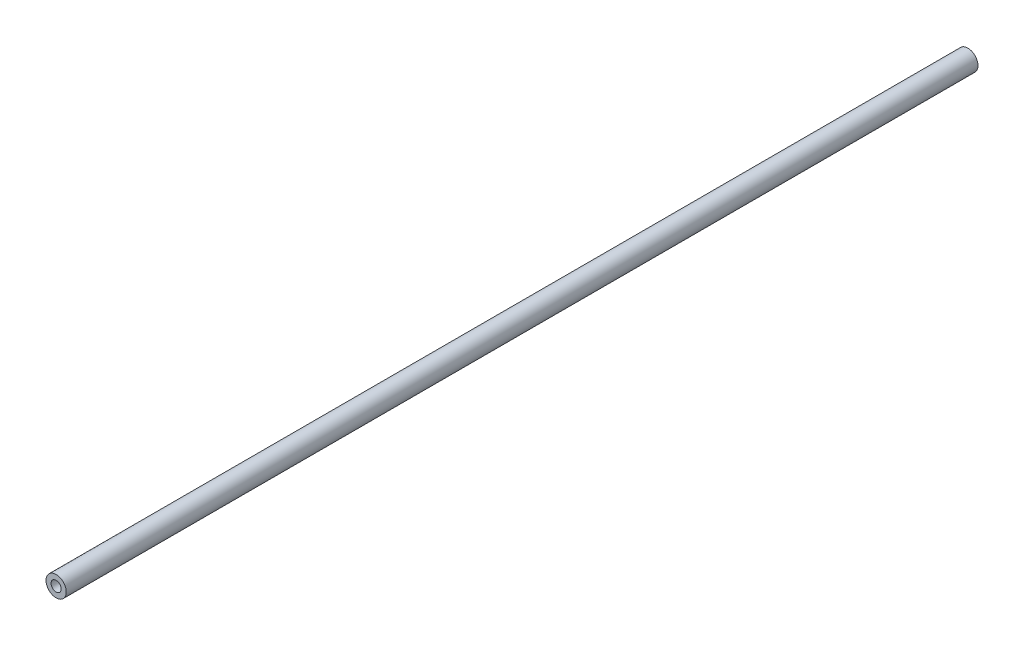
ISO-10303-21;
HEADER;
FILE_DESCRIPTION(('STEP AP214'),'2;1');
FILE_NAME('part.step','',(''),(''),'','','');
FILE_SCHEMA(('AUTOMOTIVE_DESIGN { 1 0 10303 214 1 1 1 1 }'));
ENDSEC;
DATA;
#1=APPLICATION_CONTEXT('core data for automotive mechanical design processes');
#2=APPLICATION_PROTOCOL_DEFINITION('international standard','automotive_design',2000,#1);
#3=PRODUCT_CONTEXT('',#1,'mechanical');
#4=PRODUCT('Part','Part','',(#3));
#5=PRODUCT_RELATED_PRODUCT_CATEGORY('part','',(#4));
#6=PRODUCT_DEFINITION_FORMATION('','',#4);
#7=PRODUCT_DEFINITION_CONTEXT('part definition',#1,'design');
#8=PRODUCT_DEFINITION('design','',#6,#7);
#9=PRODUCT_DEFINITION_SHAPE('','',#8);
#10=(LENGTH_UNIT() NAMED_UNIT(*) SI_UNIT(.MILLI.,.METRE.));
#11=(NAMED_UNIT(*) PLANE_ANGLE_UNIT() SI_UNIT($,.RADIAN.));
#12=(NAMED_UNIT(*) SI_UNIT($,.STERADIAN.) SOLID_ANGLE_UNIT());
#13=UNCERTAINTY_MEASURE_WITH_UNIT(LENGTH_MEASURE(1.E-05),#10,'distance_accuracy_value','');
#14=(GEOMETRIC_REPRESENTATION_CONTEXT(3) GLOBAL_UNCERTAINTY_ASSIGNED_CONTEXT((#13)) GLOBAL_UNIT_ASSIGNED_CONTEXT((#10,
#11,#12)) REPRESENTATION_CONTEXT('',''));
#15=CARTESIAN_POINT('',(0.,0.,0.));
#16=DIRECTION('',(0.,0.,1.));
#17=DIRECTION('',(1.,0.,0.));
#18=AXIS2_PLACEMENT_3D('',#15,#16,#17);
#19=CARTESIAN_POINT('',(0.,0.,180.));
#20=DIRECTION('',(0.,0.,1.));
#21=DIRECTION('',(1.,0.,0.));
#22=AXIS2_PLACEMENT_3D('',#19,#20,#21);
#23=PLANE('',#22);
#24=CARTESIAN_POINT('',(0.,0.,180.));
#25=DIRECTION('',(0.,0.,1.));
#26=DIRECTION('',(1.,0.,0.));
#27=AXIS2_PLACEMENT_3D('',#24,#25,#26);
#28=CIRCLE('',#27,2.);
#29=CARTESIAN_POINT('',(2.,0.,180.));
#30=VERTEX_POINT('',#29);
#31=EDGE_CURVE('E10',#30,#30,#28,.T.);
#32=ORIENTED_EDGE('',*,*,#31,.T.);
#33=EDGE_LOOP('',(#32));
#34=FACE_BOUND('',#33,.T.);
#35=CARTESIAN_POINT('',(0.,0.,180.));
#36=DIRECTION('',(0.,0.,1.));
#37=DIRECTION('',(1.,0.,0.));
#38=AXIS2_PLACEMENT_3D('',#35,#36,#37);
#39=CIRCLE('',#38,1.);
#40=CARTESIAN_POINT('',(1.,0.,180.));
#41=VERTEX_POINT('',#40);
#42=EDGE_CURVE('E43',#41,#41,#39,.T.);
#43=ORIENTED_EDGE('',*,*,#42,.F.);
#44=EDGE_LOOP('',(#43));
#45=FACE_BOUND('',#44,.T.);
#46=ADVANCED_FACE('F32',(#34,#45),#23,.T.);
#47=CARTESIAN_POINT('',(0.,0.,0.));
#48=DIRECTION('',(0.,0.,1.));
#49=DIRECTION('',(1.,0.,0.));
#50=AXIS2_PLACEMENT_3D('',#47,#48,#49);
#51=PLANE('',#50);
#52=CARTESIAN_POINT('',(0.,0.,0.));
#53=DIRECTION('',(0.,0.,1.));
#54=DIRECTION('',(1.,0.,0.));
#55=AXIS2_PLACEMENT_3D('',#52,#53,#54);
#56=CIRCLE('',#55,2.);
#57=CARTESIAN_POINT('',(2.,0.,0.));
#58=VERTEX_POINT('',#57);
#59=EDGE_CURVE('E36',#58,#58,#56,.T.);
#60=ORIENTED_EDGE('',*,*,#59,.F.);
#61=EDGE_LOOP('',(#60));
#62=FACE_BOUND('',#61,.T.);
#63=CARTESIAN_POINT('',(0.,0.,0.));
#64=DIRECTION('',(0.,0.,1.));
#65=DIRECTION('',(1.,0.,0.));
#66=AXIS2_PLACEMENT_3D('',#63,#64,#65);
#67=CIRCLE('',#66,1.);
#68=CARTESIAN_POINT('',(1.,0.,0.));
#69=VERTEX_POINT('',#68);
#70=EDGE_CURVE('E45',#69,#69,#67,.T.);
#71=ORIENTED_EDGE('',*,*,#70,.T.);
#72=EDGE_LOOP('',(#71));
#73=FACE_BOUND('',#72,.T.);
#74=ADVANCED_FACE('F55',(#62,#73),#51,.F.);
#75=CARTESIAN_POINT('',(0.,0.,180.));
#76=DIRECTION('',(0.,0.,-1.));
#77=DIRECTION('',(-1.,0.,0.));
#78=AXIS2_PLACEMENT_3D('',#75,#76,#77);
#79=CYLINDRICAL_SURFACE('',#78,2.);
#80=ORIENTED_EDGE('',*,*,#31,.F.);
#81=EDGE_LOOP('',(#80));
#82=FACE_BOUND('',#81,.T.);
#83=ORIENTED_EDGE('',*,*,#59,.T.);
#84=EDGE_LOOP('',(#83));
#85=FACE_BOUND('',#84,.T.);
#86=ADVANCED_FACE('F34',(#82,#85),#79,.T.);
#87=CARTESIAN_POINT('',(0.,0.,180.));
#88=DIRECTION('',(0.,0.,-1.));
#89=DIRECTION('',(-1.,0.,0.));
#90=AXIS2_PLACEMENT_3D('',#87,#88,#89);
#91=CYLINDRICAL_SURFACE('',#90,1.);
#92=ORIENTED_EDGE('',*,*,#42,.T.);
#93=EDGE_LOOP('',(#92));
#94=FACE_BOUND('',#93,.T.);
#95=ORIENTED_EDGE('',*,*,#70,.F.);
#96=EDGE_LOOP('',(#95));
#97=FACE_BOUND('',#96,.T.);
#98=ADVANCED_FACE('F51',(#94,#97),#91,.F.);
#99=CLOSED_SHELL('',(#46,#74,#86,#98));
#100=MANIFOLD_SOLID_BREP('B2',#99);
#101=ADVANCED_BREP_SHAPE_REPRESENTATION('',(#18,#100),#14);
#102=SHAPE_DEFINITION_REPRESENTATION(#9,#101);
ENDSEC;
END-ISO-10303-21;
